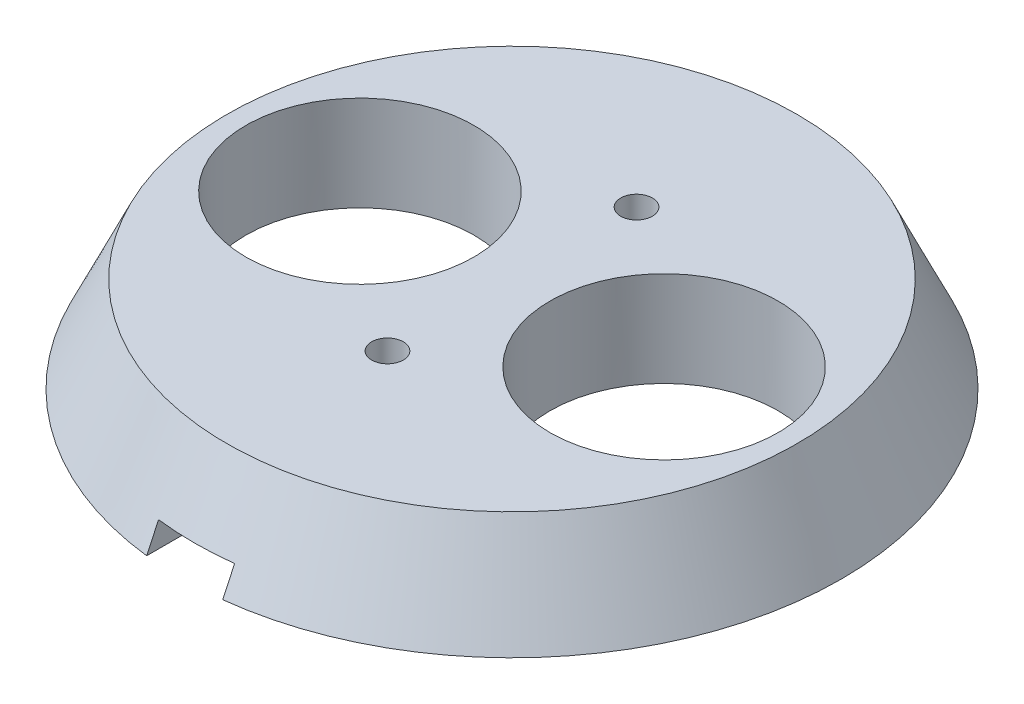
ISO-10303-21;
HEADER;
FILE_DESCRIPTION(('STEP AP214'),'2;1');
FILE_NAME('part.step','',(''),(''),'','','');
FILE_SCHEMA(('AUTOMOTIVE_DESIGN { 1 0 10303 214 1 1 1 1 }'));
ENDSEC;
DATA;
#1=APPLICATION_CONTEXT('core data for automotive mechanical design processes');
#2=APPLICATION_PROTOCOL_DEFINITION('international standard','automotive_design',2000,#1);
#3=PRODUCT_CONTEXT('',#1,'mechanical');
#4=PRODUCT('Part','Part','',(#3));
#5=PRODUCT_RELATED_PRODUCT_CATEGORY('part','',(#4));
#6=PRODUCT_DEFINITION_FORMATION('','',#4);
#7=PRODUCT_DEFINITION_CONTEXT('part definition',#1,'design');
#8=PRODUCT_DEFINITION('design','',#6,#7);
#9=PRODUCT_DEFINITION_SHAPE('','',#8);
#10=(LENGTH_UNIT() NAMED_UNIT(*) SI_UNIT(.MILLI.,.METRE.));
#11=(NAMED_UNIT(*) PLANE_ANGLE_UNIT() SI_UNIT($,.RADIAN.));
#12=(NAMED_UNIT(*) SI_UNIT($,.STERADIAN.) SOLID_ANGLE_UNIT());
#13=UNCERTAINTY_MEASURE_WITH_UNIT(LENGTH_MEASURE(1.E-05),#10,'distance_accuracy_value','');
#14=(GEOMETRIC_REPRESENTATION_CONTEXT(3) GLOBAL_UNCERTAINTY_ASSIGNED_CONTEXT((#13)) GLOBAL_UNIT_ASSIGNED_CONTEXT((#10,
#11,#12)) REPRESENTATION_CONTEXT('',''));
#15=CARTESIAN_POINT('',(0.,0.,0.));
#16=DIRECTION('',(0.,0.,1.));
#17=DIRECTION('',(1.,0.,0.));
#18=AXIS2_PLACEMENT_3D('',#15,#16,#17);
#19=CARTESIAN_POINT('',(40.5,3.5,5.));
#20=DIRECTION('',(0.,1.,0.));
#21=DIRECTION('',(0.,0.,1.));
#22=AXIS2_PLACEMENT_3D('',#19,#20,#21);
#23=CYLINDRICAL_SURFACE('',#22,8.99999999999999);
#24=CARTESIAN_POINT('',(40.5,-7.5,5.));
#25=DIRECTION('',(0.,-1.,0.));
#26=DIRECTION('',(0.,0.,-1.));
#27=AXIS2_PLACEMENT_3D('',#24,#25,#26);
#28=CIRCLE('',#27,9.);
#29=CARTESIAN_POINT('',(40.5,-7.5,-4.00000000000001));
#30=VERTEX_POINT('',#29);
#31=EDGE_CURVE('E250',#30,#30,#28,.T.);
#32=ORIENTED_EDGE('',*,*,#31,.T.);
#33=EDGE_LOOP('',(#32));
#34=FACE_BOUND('',#33,.T.);
#35=CARTESIAN_POINT('',(40.5,0.,5.));
#36=DIRECTION('',(0.,1.,0.));
#37=DIRECTION('',(0.,0.,1.));
#38=AXIS2_PLACEMENT_3D('',#35,#36,#37);
#39=CIRCLE('',#38,8.99999999999999);
#40=CARTESIAN_POINT('',(40.5,0.,14.));
#41=VERTEX_POINT('',#40);
#42=EDGE_CURVE('E223',#41,#41,#39,.F.);
#43=ORIENTED_EDGE('',*,*,#42,.F.);
#44=EDGE_LOOP('',(#43));
#45=FACE_BOUND('',#44,.T.);
#46=ADVANCED_FACE('F36',(#34,#45),#23,.F.);
#47=CARTESIAN_POINT('',(64.5,3.5,5.));
#48=DIRECTION('',(0.,1.,0.));
#49=DIRECTION('',(0.,0.,1.));
#50=AXIS2_PLACEMENT_3D('',#47,#48,#49);
#51=CYLINDRICAL_SURFACE('',#50,8.99999999999999);
#52=CARTESIAN_POINT('',(64.5,-7.5,5.));
#53=DIRECTION('',(0.,-1.,0.));
#54=DIRECTION('',(0.,0.,-1.));
#55=AXIS2_PLACEMENT_3D('',#52,#53,#54);
#56=CIRCLE('',#55,9.);
#57=CARTESIAN_POINT('',(64.5,-7.5,-4.));
#58=VERTEX_POINT('',#57);
#59=EDGE_CURVE('E247',#58,#58,#56,.T.);
#60=ORIENTED_EDGE('',*,*,#59,.T.);
#61=EDGE_LOOP('',(#60));
#62=FACE_BOUND('',#61,.T.);
#63=CARTESIAN_POINT('',(64.5,0.,5.));
#64=DIRECTION('',(0.,1.,0.));
#65=DIRECTION('',(0.,0.,1.));
#66=AXIS2_PLACEMENT_3D('',#63,#64,#65);
#67=CIRCLE('',#66,8.99999999999999);
#68=CARTESIAN_POINT('',(64.5,0.,14.));
#69=VERTEX_POINT('',#68);
#70=EDGE_CURVE('E327',#69,#69,#67,.F.);
#71=ORIENTED_EDGE('',*,*,#70,.F.);
#72=EDGE_LOOP('',(#71));
#73=FACE_BOUND('',#72,.T.);
#74=ADVANCED_FACE('F192',(#62,#73),#51,.F.);
#75=CARTESIAN_POINT('',(52.5,-7.5,5.));
#76=DIRECTION('',(0.,1.,0.));
#77=DIRECTION('',(0.,0.,1.));
#78=AXIS2_PLACEMENT_3D('',#75,#76,#77);
#79=PLANE('',#78);
#80=CARTESIAN_POINT('',(52.5,-7.5,14.8263431402899));
#81=DIRECTION('',(0.,-1.,0.));
#82=DIRECTION('',(0.,0.,-1.));
#83=AXIS2_PLACEMENT_3D('',#80,#81,#82);
#84=CIRCLE('',#83,1.24999999999999);
#85=CARTESIAN_POINT('',(52.5,-7.5,13.5763431402899));
#86=VERTEX_POINT('',#85);
#87=EDGE_CURVE('E315',#86,#86,#84,.T.);
#88=ORIENTED_EDGE('',*,*,#87,.F.);
#89=EDGE_LOOP('',(#88));
#90=FACE_BOUND('',#89,.T.);
#91=CARTESIAN_POINT('',(52.5,-7.5,-4.82634314028992));
#92=DIRECTION('',(0.,-1.,0.));
#93=DIRECTION('',(0.,0.,-1.));
#94=AXIS2_PLACEMENT_3D('',#91,#92,#93);
#95=CIRCLE('',#94,1.24999999999999);
#96=CARTESIAN_POINT('',(52.5,-7.5,-6.07634314028991));
#97=VERTEX_POINT('',#96);
#98=EDGE_CURVE('E319',#97,#97,#95,.T.);
#99=ORIENTED_EDGE('',*,*,#98,.F.);
#100=EDGE_LOOP('',(#99));
#101=FACE_BOUND('',#100,.T.);
#102=ORIENTED_EDGE('',*,*,#59,.F.);
#103=EDGE_LOOP('',(#102));
#104=FACE_BOUND('',#103,.T.);
#105=ORIENTED_EDGE('',*,*,#31,.F.);
#106=EDGE_LOOP('',(#105));
#107=FACE_BOUND('',#106,.T.);
#108=DIRECTION('',(-1.,0.,0.));
#109=VECTOR('',#108,1.);
#110=CARTESIAN_POINT('',(49.5,-7.5,-9.82634314028992));
#111=LINE('',#110,#109);
#112=CARTESIAN_POINT('',(55.5,-7.5,-9.82634314028992));
#113=VERTEX_POINT('',#112);
#114=CARTESIAN_POINT('',(49.5,-7.5,-9.82634314028992));
#115=VERTEX_POINT('',#114);
#116=EDGE_CURVE('E47',#113,#115,#111,.T.);
#117=ORIENTED_EDGE('',*,*,#116,.F.);
#118=DIRECTION('',(0.,0.,1.));
#119=VECTOR('',#118,1.);
#120=CARTESIAN_POINT('',(55.5,-7.5,-9.82634314028992));
#121=LINE('',#120,#119);
#122=CARTESIAN_POINT('',(55.5000117710377,-7.5,-20.8263431675805));
#123=VERTEX_POINT('',#122);
#124=EDGE_CURVE('E114',#123,#113,#121,.T.);
#125=ORIENTED_EDGE('',*,*,#124,.F.);
#126=CARTESIAN_POINT('',(52.5,-7.5,5.));
#127=DIRECTION('',(0.,1.,0.));
#128=DIRECTION('',(0.,0.,1.));
#129=AXIS2_PLACEMENT_3D('',#126,#127,#128);
#130=CIRCLE('',#129,26.);
#131=CARTESIAN_POINT('',(55.5,-7.5,30.8263431402899));
#132=VERTEX_POINT('',#131);
#133=EDGE_CURVE('E220',#132,#123,#130,.T.);
#134=ORIENTED_EDGE('',*,*,#133,.F.);
#135=DIRECTION('',(0.,0.,1.));
#136=VECTOR('',#135,1.);
#137=CARTESIAN_POINT('',(55.5,-7.5,19.8263431402899));
#138=LINE('',#137,#136);
#139=CARTESIAN_POINT('',(55.5,-7.5,19.8263431402899));
#140=VERTEX_POINT('',#139);
#141=EDGE_CURVE('E110',#140,#132,#138,.T.);
#142=ORIENTED_EDGE('',*,*,#141,.F.);
#143=DIRECTION('',(1.,0.,0.));
#144=VECTOR('',#143,1.);
#145=CARTESIAN_POINT('',(49.5,-7.5,19.8263431402899));
#146=LINE('',#145,#144);
#147=CARTESIAN_POINT('',(49.5,-7.5,19.8263431402899));
#148=VERTEX_POINT('',#147);
#149=EDGE_CURVE('E240',#148,#140,#146,.T.);
#150=ORIENTED_EDGE('',*,*,#149,.F.);
#151=DIRECTION('',(0.,0.,-1.));
#152=VECTOR('',#151,1.);
#153=CARTESIAN_POINT('',(49.5,-7.5,19.8263431402899));
#154=LINE('',#153,#152);
#155=CARTESIAN_POINT('',(49.4999881542383,-7.5,30.8263431589));
#156=VERTEX_POINT('',#155);
#157=EDGE_CURVE('E181',#156,#148,#154,.T.);
#158=ORIENTED_EDGE('',*,*,#157,.F.);
#159=CARTESIAN_POINT('',(49.5,-7.5,-20.8263431402899));
#160=VERTEX_POINT('',#159);
#161=EDGE_CURVE('E217',#160,#156,#130,.T.);
#162=ORIENTED_EDGE('',*,*,#161,.F.);
#163=DIRECTION('',(0.,0.,-1.));
#164=VECTOR('',#163,1.);
#165=CARTESIAN_POINT('',(49.5,-7.5,-9.82634314028992));
#166=LINE('',#165,#164);
#167=EDGE_CURVE('E212',#115,#160,#166,.T.);
#168=ORIENTED_EDGE('',*,*,#167,.F.);
#169=EDGE_LOOP('',(#117,#125,#134,#142,#150,#158,#162,#168));
#170=FACE_BOUND('',#169,.T.);
#171=ADVANCED_FACE('F38',(#90,#101,#104,#107,#170),#79,.F.);
#172=CARTESIAN_POINT('',(52.5,0.,5.));
#173=DIRECTION('',(0.,-1.,0.));
#174=DIRECTION('',(0.,0.,-1.));
#175=AXIS2_PLACEMENT_3D('',#172,#173,#174);
#176=CONICAL_SURFACE('',#175,22.5,0.436627159813542);
#177=CARTESIAN_POINT('',(55.5,12.5602768294078,-11.3658464327506));
#178=CARTESIAN_POINT('',(55.5,11.7814361719645,-11.7353564698702));
#179=CARTESIAN_POINT('',(55.5,11.0024421127457,-12.1045429455506));
#180=CARTESIAN_POINT('',(55.5,9.44419429337647,-12.8423671412298));
#181=CARTESIAN_POINT('',(55.5,8.66494053326612,-13.2110048613132));
#182=CARTESIAN_POINT('',(55.5,6.32686082731465,-14.3162422162979));
#183=CARTESIAN_POINT('',(55.5,4.76771562459884,-15.0521664400531));
#184=CARTESIAN_POINT('',(55.5,1.64882071409109,-16.5227275113106));
#185=CARTESIAN_POINT('',(55.5,0.0890710070281218,-17.2573643603595));
#186=CARTESIAN_POINT('',(55.5,-3.03087832700619,-18.7256825861429));
#187=CARTESIAN_POINT('',(55.5,-4.59107795404876,-19.459363962726));
#188=CARTESIAN_POINT('',(55.5,-7.71181727272587,-20.9259981183879));
#189=CARTESIAN_POINT('',(55.5,-9.27235696394594,-21.6589508983487));
#190=CARTESIAN_POINT('',(55.5,-12.3937028695853,-23.1242888222354));
#191=CARTESIAN_POINT('',(55.5,-13.954509084013,-23.8566739661434));
#192=CARTESIAN_POINT('',(55.5,-17.076334364193,-25.3209952321239));
#193=CARTESIAN_POINT('',(55.5,-18.6373534301945,-26.0529313536654));
#194=CARTESIAN_POINT('',(55.5,-21.7595637611938,-27.5164359187512));
#195=CARTESIAN_POINT('',(55.5,-23.320755026178,-28.2480043623246));
#196=CARTESIAN_POINT('',(55.5,-24.8820131088047,-28.9794301292932));
#197=B_SPLINE_CURVE_WITH_KNOTS('',3,(#177,#178,#179,#180,#181,#182,#183,#184,#185,#186,#187,
#188,#189,#190,#191,#192,#193,#194,#195,#196),.UNSPECIFIED.,.F.,.F.,(4,2,2,2,2,2,2,2,2,4),(0.,
2.58615018878239,5.17229997930514,10.3445968004934,15.5168874035556,20.6891788258247,
25.8614639789069,31.0337492960015,36.2060407191065,41.3783317339585),.UNSPECIFIED.);
#198=CARTESIAN_POINT('',(55.5,-5.5,-19.8864979010261));
#199=VERTEX_POINT('',#198);
#200=EDGE_CURVE('E216',#199,#123,#197,.T.);
#201=ORIENTED_EDGE('',*,*,#200,.F.);
#202=CARTESIAN_POINT('',(52.5,-5.5,5.));
#203=DIRECTION('',(0.,-1.,0.));
#204=DIRECTION('',(0.,0.,-1.));
#205=AXIS2_PLACEMENT_3D('',#202,#203,#204);
#206=CIRCLE('',#205,25.0666666666667);
#207=CARTESIAN_POINT('',(49.5,-5.5,-19.8864979010261));
#208=VERTEX_POINT('',#207);
#209=EDGE_CURVE('E107',#199,#208,#206,.F.);
#210=ORIENTED_EDGE('',*,*,#209,.T.);
#211=CARTESIAN_POINT('',(49.5,-24.8820131088047,-28.9794301292932));
#212=CARTESIAN_POINT('',(49.5,-23.320755026178,-28.2480043623246));
#213=CARTESIAN_POINT('',(49.5,-21.7595637611938,-27.5164359187512));
#214=CARTESIAN_POINT('',(49.5,-18.6373534301945,-26.0529313536654));
#215=CARTESIAN_POINT('',(49.5,-17.076334364193,-25.3209952321239));
#216=CARTESIAN_POINT('',(49.5,-13.954509084013,-23.8566739661434));
#217=CARTESIAN_POINT('',(49.5,-12.3937028695853,-23.1242888222354));
#218=CARTESIAN_POINT('',(49.5,-9.27235696394594,-21.6589508983487));
#219=CARTESIAN_POINT('',(49.5,-7.71181727272587,-20.9259981183879));
#220=CARTESIAN_POINT('',(49.5,-4.59107795404876,-19.459363962726));
#221=CARTESIAN_POINT('',(49.5,-3.03087832700619,-18.7256825861429));
#222=CARTESIAN_POINT('',(49.5,0.0890710070281212,-17.2573643603595));
#223=CARTESIAN_POINT('',(49.5,1.64882071409109,-16.5227275113106));
#224=CARTESIAN_POINT('',(49.5,4.76771562459884,-15.0521664400531));
#225=CARTESIAN_POINT('',(49.5,6.32686082731465,-14.3162422162979));
#226=CARTESIAN_POINT('',(49.5,8.66494053326612,-13.2110048613132));
#227=CARTESIAN_POINT('',(49.5,9.44419429337647,-12.8423671412298));
#228=CARTESIAN_POINT('',(49.5,11.0024421127457,-12.1045429455506));
#229=CARTESIAN_POINT('',(49.5,11.7814361719645,-11.7353564698702));
#230=CARTESIAN_POINT('',(49.5,12.5602768294078,-11.3658464327506));
#231=B_SPLINE_CURVE_WITH_KNOTS('',3,(#211,#212,#213,#214,#215,#216,#217,#218,#219,#220,#221,
#222,#223,#224,#225,#226,#227,#228,#229,#230),.UNSPECIFIED.,.F.,.F.,(4,2,2,2,2,2,2,2,2,4),(0.,
5.17229101485203,10.344582437957,15.5168677550516,20.6891529081338,25.8614443304029,
31.0337349334651,36.2060317546534,38.7921815451761,41.3783317339585),.UNSPECIFIED.);
#232=EDGE_CURVE('E119',#160,#208,#231,.T.);
#233=ORIENTED_EDGE('',*,*,#232,.F.);
#234=ORIENTED_EDGE('',*,*,#161,.T.);
#235=CARTESIAN_POINT('',(49.5,12.5602768294078,21.3658464327506));
#236=CARTESIAN_POINT('',(49.5,11.7814361719645,21.7353564698702));
#237=CARTESIAN_POINT('',(49.5,11.0024421127457,22.1045429455506));
#238=CARTESIAN_POINT('',(49.5,9.44419429337647,22.8423671412298));
#239=CARTESIAN_POINT('',(49.5,8.66494053326612,23.2110048613132));
#240=CARTESIAN_POINT('',(49.5,6.32686082731464,24.3162422162979));
#241=CARTESIAN_POINT('',(49.5,4.76771562459884,25.0521664400531));
#242=CARTESIAN_POINT('',(49.5,1.64882071409109,26.5227275113106));
#243=CARTESIAN_POINT('',(49.5,0.0890710070281259,27.2573643603595));
#244=CARTESIAN_POINT('',(49.5,-3.03087832700619,28.7256825861429));
#245=CARTESIAN_POINT('',(49.5,-4.59107795404876,29.459363962726));
#246=CARTESIAN_POINT('',(49.5,-7.71181727272587,30.9259981183879));
#247=CARTESIAN_POINT('',(49.5,-9.27235696394593,31.6589508983487));
#248=CARTESIAN_POINT('',(49.5,-12.3937028695853,33.1242888222354));
#249=CARTESIAN_POINT('',(49.5,-13.954509084013,33.8566739661434));
#250=CARTESIAN_POINT('',(49.5,-17.076334364193,35.3209952321239));
#251=CARTESIAN_POINT('',(49.5,-18.6373534301945,36.0529313536654));
#252=CARTESIAN_POINT('',(49.5,-21.7595637611937,37.5164359187512));
#253=CARTESIAN_POINT('',(49.5,-23.3207550261779,38.2480043623246));
#254=CARTESIAN_POINT('',(49.5,-24.8820131088047,38.9794301292932));
#255=B_SPLINE_CURVE_WITH_KNOTS('',3,(#235,#236,#237,#238,#239,#240,#241,#242,#243,#244,#245,
#246,#247,#248,#249,#250,#251,#252,#253,#254),.UNSPECIFIED.,.F.,.F.,(4,2,2,2,2,2,2,2,2,4),(0.,
2.58615018878239,5.17229997930514,10.3445968004934,15.5168874035556,20.6891788258247,
25.8614639789069,31.0337492960015,36.2060407191065,41.3783317339585),.UNSPECIFIED.);
#256=CARTESIAN_POINT('',(49.5,-5.5,29.8864979010261));
#257=VERTEX_POINT('',#256);
#258=EDGE_CURVE('E233',#257,#156,#255,.T.);
#259=ORIENTED_EDGE('',*,*,#258,.F.);
#260=CARTESIAN_POINT('',(52.5,-5.5,5.));
#261=DIRECTION('',(0.,1.,0.));
#262=DIRECTION('',(0.,0.,1.));
#263=AXIS2_PLACEMENT_3D('',#260,#261,#262);
#264=CIRCLE('',#263,25.0666666666667);
#265=CARTESIAN_POINT('',(55.5,-5.5,29.8864979010261));
#266=VERTEX_POINT('',#265);
#267=EDGE_CURVE('E237',#266,#257,#264,.F.);
#268=ORIENTED_EDGE('',*,*,#267,.F.);
#269=CARTESIAN_POINT('',(55.5,-24.8820131088047,38.9794301292932));
#270=CARTESIAN_POINT('',(55.5,-23.320755026178,38.2480043623246));
#271=CARTESIAN_POINT('',(55.5,-21.7595637611937,37.5164359187512));
#272=CARTESIAN_POINT('',(55.5,-18.6373534301945,36.0529313536654));
#273=CARTESIAN_POINT('',(55.5,-17.076334364193,35.3209952321239));
#274=CARTESIAN_POINT('',(55.5,-13.954509084013,33.8566739661434));
#275=CARTESIAN_POINT('',(55.5,-12.3937028695853,33.1242888222354));
#276=CARTESIAN_POINT('',(55.5,-9.27235696394594,31.6589508983487));
#277=CARTESIAN_POINT('',(55.5,-7.71181727272587,30.9259981183879));
#278=CARTESIAN_POINT('',(55.5,-4.59107795404876,29.459363962726));
#279=CARTESIAN_POINT('',(55.5,-3.03087832700619,28.7256825861429));
#280=CARTESIAN_POINT('',(55.5,0.0890710070281251,27.2573643603595));
#281=CARTESIAN_POINT('',(55.5,1.64882071409109,26.5227275113106));
#282=CARTESIAN_POINT('',(55.5,4.76771562459884,25.0521664400531));
#283=CARTESIAN_POINT('',(55.5,6.32686082731465,24.3162422162979));
#284=CARTESIAN_POINT('',(55.5,8.66494053326612,23.2110048613132));
#285=CARTESIAN_POINT('',(55.5,9.44419429337647,22.8423671412298));
#286=CARTESIAN_POINT('',(55.5,11.0024421127457,22.1045429455506));
#287=CARTESIAN_POINT('',(55.5,11.7814361719645,21.7353564698702));
#288=CARTESIAN_POINT('',(55.5,12.5602768294078,21.3658464327506));
#289=B_SPLINE_CURVE_WITH_KNOTS('',3,(#269,#270,#271,#272,#273,#274,#275,#276,#277,#278,#279,
#280,#281,#282,#283,#284,#285,#286,#287,#288),.UNSPECIFIED.,.F.,.F.,(4,2,2,2,2,2,2,2,2,4),(0.,
5.17229101485204,10.344582437957,15.5168677550516,20.6891529081338,25.8614443304029,
31.0337349334651,36.2060317546534,38.7921815451761,41.3783317339585),.UNSPECIFIED.);
#290=EDGE_CURVE('E180',#132,#266,#289,.T.);
#291=ORIENTED_EDGE('',*,*,#290,.F.);
#292=ORIENTED_EDGE('',*,*,#133,.T.);
#293=EDGE_LOOP('',(#201,#210,#233,#234,#259,#268,#291,#292));
#294=FACE_BOUND('',#293,.T.);
#295=CARTESIAN_POINT('',(52.5,0.,5.));
#296=DIRECTION('',(0.,-1.,0.));
#297=DIRECTION('',(0.,0.,-1.));
#298=AXIS2_PLACEMENT_3D('',#295,#296,#297);
#299=CIRCLE('',#298,22.5);
#300=CARTESIAN_POINT('',(52.5,0.,-17.5));
#301=VERTEX_POINT('',#300);
#302=EDGE_CURVE('E218',#301,#301,#299,.T.);
#303=ORIENTED_EDGE('',*,*,#302,.T.);
#304=EDGE_LOOP('',(#303));
#305=FACE_BOUND('',#304,.T.);
#306=ADVANCED_FACE('F130',(#294,#305),#176,.T.);
#307=CARTESIAN_POINT('',(0.,-5.5,0.));
#308=DIRECTION('',(0.,1.,0.));
#309=DIRECTION('',(0.,0.,1.));
#310=AXIS2_PLACEMENT_3D('',#307,#308,#309);
#311=PLANE('',#310);
#312=ORIENTED_EDGE('',*,*,#267,.T.);
#313=DIRECTION('',(0.,0.,-1.));
#314=VECTOR('',#313,1.);
#315=CARTESIAN_POINT('',(49.5,-5.5,19.8263431402899));
#316=LINE('',#315,#314);
#317=CARTESIAN_POINT('',(49.5,-5.5,19.8263431402899));
#318=VERTEX_POINT('',#317);
#319=EDGE_CURVE('E235',#257,#318,#316,.T.);
#320=ORIENTED_EDGE('',*,*,#319,.T.);
#321=DIRECTION('',(1.,0.,0.));
#322=VECTOR('',#321,1.);
#323=CARTESIAN_POINT('',(49.5,-5.5,19.8263431402899));
#324=LINE('',#323,#322);
#325=CARTESIAN_POINT('',(55.5,-5.5,19.8263431402899));
#326=VERTEX_POINT('',#325);
#327=EDGE_CURVE('E234',#318,#326,#324,.T.);
#328=ORIENTED_EDGE('',*,*,#327,.T.);
#329=DIRECTION('',(0.,0.,1.));
#330=VECTOR('',#329,1.);
#331=CARTESIAN_POINT('',(55.5,-5.5,19.8263431402899));
#332=LINE('',#331,#330);
#333=EDGE_CURVE('E231',#326,#266,#332,.T.);
#334=ORIENTED_EDGE('',*,*,#333,.T.);
#335=EDGE_LOOP('',(#312,#320,#328,#334));
#336=FACE_BOUND('',#335,.T.);
#337=ADVANCED_FACE('F139',(#336),#311,.F.);
#338=CARTESIAN_POINT('',(49.5,-5.5,19.8263431402899));
#339=DIRECTION('',(-1.,0.,0.));
#340=DIRECTION('',(0.,0.,1.));
#341=AXIS2_PLACEMENT_3D('',#338,#339,#340);
#342=PLANE('',#341);
#343=ORIENTED_EDGE('',*,*,#258,.T.);
#344=ORIENTED_EDGE('',*,*,#157,.T.);
#345=DIRECTION('',(0.,-1.,0.));
#346=VECTOR('',#345,1.);
#347=CARTESIAN_POINT('',(49.5,-5.5,19.8263431402899));
#348=LINE('',#347,#346);
#349=EDGE_CURVE('E243',#318,#148,#348,.T.);
#350=ORIENTED_EDGE('',*,*,#349,.F.);
#351=ORIENTED_EDGE('',*,*,#319,.F.);
#352=EDGE_LOOP('',(#343,#344,#350,#351));
#353=FACE_BOUND('',#352,.T.);
#354=ADVANCED_FACE('F189',(#353),#342,.F.);
#355=CARTESIAN_POINT('',(49.5,-5.5,19.8263431402899));
#356=DIRECTION('',(0.,0.,-1.));
#357=DIRECTION('',(-1.,0.,0.));
#358=AXIS2_PLACEMENT_3D('',#355,#356,#357);
#359=PLANE('',#358);
#360=ORIENTED_EDGE('',*,*,#149,.T.);
#361=DIRECTION('',(0.,-1.,0.));
#362=VECTOR('',#361,1.);
#363=CARTESIAN_POINT('',(55.5,-5.5,19.8263431402899));
#364=LINE('',#363,#362);
#365=EDGE_CURVE('E244',#326,#140,#364,.T.);
#366=ORIENTED_EDGE('',*,*,#365,.F.);
#367=ORIENTED_EDGE('',*,*,#327,.F.);
#368=ORIENTED_EDGE('',*,*,#349,.T.);
#369=EDGE_LOOP('',(#360,#366,#367,#368));
#370=FACE_BOUND('',#369,.T.);
#371=ADVANCED_FACE('F187',(#370),#359,.F.);
#372=CARTESIAN_POINT('',(55.5,-5.5,19.8263431402899));
#373=DIRECTION('',(1.,0.,0.));
#374=DIRECTION('',(0.,0.,-1.));
#375=AXIS2_PLACEMENT_3D('',#372,#373,#374);
#376=PLANE('',#375);
#377=ORIENTED_EDGE('',*,*,#290,.T.);
#378=ORIENTED_EDGE('',*,*,#333,.F.);
#379=ORIENTED_EDGE('',*,*,#365,.T.);
#380=ORIENTED_EDGE('',*,*,#141,.T.);
#381=EDGE_LOOP('',(#377,#378,#379,#380));
#382=FACE_BOUND('',#381,.T.);
#383=ADVANCED_FACE('F183',(#382),#376,.F.);
#384=CARTESIAN_POINT('',(0.,-5.5,0.));
#385=DIRECTION('',(0.,-1.,0.));
#386=DIRECTION('',(0.,0.,-1.));
#387=AXIS2_PLACEMENT_3D('',#384,#385,#386);
#388=PLANE('',#387);
#389=DIRECTION('',(0.,0.,1.));
#390=VECTOR('',#389,1.);
#391=CARTESIAN_POINT('',(55.5,-5.5,-9.82634314028992));
#392=LINE('',#391,#390);
#393=CARTESIAN_POINT('',(55.5,-5.5,-9.82634314028992));
#394=VERTEX_POINT('',#393);
#395=EDGE_CURVE('E103',#199,#394,#392,.T.);
#396=ORIENTED_EDGE('',*,*,#395,.T.);
#397=DIRECTION('',(-1.,0.,0.));
#398=VECTOR('',#397,1.);
#399=CARTESIAN_POINT('',(49.5,-5.5,-9.82634314028992));
#400=LINE('',#399,#398);
#401=CARTESIAN_POINT('',(49.5,-5.5,-9.82634314028992));
#402=VERTEX_POINT('',#401);
#403=EDGE_CURVE('E105',#394,#402,#400,.T.);
#404=ORIENTED_EDGE('',*,*,#403,.T.);
#405=DIRECTION('',(0.,0.,-1.));
#406=VECTOR('',#405,1.);
#407=CARTESIAN_POINT('',(49.5,-5.5,-9.82634314028992));
#408=LINE('',#407,#406);
#409=EDGE_CURVE('E99',#402,#208,#408,.T.);
#410=ORIENTED_EDGE('',*,*,#409,.T.);
#411=ORIENTED_EDGE('',*,*,#209,.F.);
#412=EDGE_LOOP('',(#396,#404,#410,#411));
#413=FACE_BOUND('',#412,.T.);
#414=ADVANCED_FACE('F104',(#413),#388,.T.);
#415=CARTESIAN_POINT('',(49.5,-5.5,-9.82634314028992));
#416=DIRECTION('',(-1.,0.,0.));
#417=DIRECTION('',(0.,0.,1.));
#418=AXIS2_PLACEMENT_3D('',#415,#416,#417);
#419=PLANE('',#418);
#420=ORIENTED_EDGE('',*,*,#232,.T.);
#421=ORIENTED_EDGE('',*,*,#409,.F.);
#422=DIRECTION('',(0.,-1.,0.));
#423=VECTOR('',#422,1.);
#424=CARTESIAN_POINT('',(49.5,-5.5,-9.82634314028992));
#425=LINE('',#424,#423);
#426=EDGE_CURVE('E117',#402,#115,#425,.T.);
#427=ORIENTED_EDGE('',*,*,#426,.T.);
#428=ORIENTED_EDGE('',*,*,#167,.T.);
#429=EDGE_LOOP('',(#420,#421,#427,#428));
#430=FACE_BOUND('',#429,.T.);
#431=ADVANCED_FACE('F201',(#430),#419,.F.);
#432=CARTESIAN_POINT('',(55.5,-5.5,-9.82634314028992));
#433=DIRECTION('',(1.,0.,0.));
#434=DIRECTION('',(0.,0.,-1.));
#435=AXIS2_PLACEMENT_3D('',#432,#433,#434);
#436=PLANE('',#435);
#437=ORIENTED_EDGE('',*,*,#200,.T.);
#438=ORIENTED_EDGE('',*,*,#124,.T.);
#439=DIRECTION('',(0.,-1.,0.));
#440=VECTOR('',#439,1.);
#441=CARTESIAN_POINT('',(55.5,-5.5,-9.82634314028992));
#442=LINE('',#441,#440);
#443=EDGE_CURVE('E12',#394,#113,#442,.T.);
#444=ORIENTED_EDGE('',*,*,#443,.F.);
#445=ORIENTED_EDGE('',*,*,#395,.F.);
#446=EDGE_LOOP('',(#437,#438,#444,#445));
#447=FACE_BOUND('',#446,.T.);
#448=ADVANCED_FACE('F112',(#447),#436,.F.);
#449=CARTESIAN_POINT('',(49.5,-5.5,-9.82634314028992));
#450=DIRECTION('',(0.,0.,1.));
#451=DIRECTION('',(1.,0.,0.));
#452=AXIS2_PLACEMENT_3D('',#449,#450,#451);
#453=PLANE('',#452);
#454=ORIENTED_EDGE('',*,*,#116,.T.);
#455=ORIENTED_EDGE('',*,*,#426,.F.);
#456=ORIENTED_EDGE('',*,*,#403,.F.);
#457=ORIENTED_EDGE('',*,*,#443,.T.);
#458=EDGE_LOOP('',(#454,#455,#456,#457));
#459=FACE_BOUND('',#458,.T.);
#460=ADVANCED_FACE('F116',(#459),#453,.F.);
#461=CARTESIAN_POINT('',(52.5,0.,5.));
#462=DIRECTION('',(0.,1.,0.));
#463=DIRECTION('',(0.,0.,1.));
#464=AXIS2_PLACEMENT_3D('',#461,#462,#463);
#465=PLANE('',#464);
#466=CARTESIAN_POINT('',(52.5,0.,14.8263431402899));
#467=DIRECTION('',(0.,1.,0.));
#468=DIRECTION('',(0.,0.,1.));
#469=AXIS2_PLACEMENT_3D('',#466,#467,#468);
#470=CIRCLE('',#469,1.24999999999999);
#471=CARTESIAN_POINT('',(52.5,0.,16.0763431402899));
#472=VERTEX_POINT('',#471);
#473=EDGE_CURVE('E333',#472,#472,#470,.T.);
#474=ORIENTED_EDGE('',*,*,#473,.F.);
#475=EDGE_LOOP('',(#474));
#476=FACE_BOUND('',#475,.T.);
#477=CARTESIAN_POINT('',(52.5,0.,-4.82634314028992));
#478=DIRECTION('',(0.,1.,0.));
#479=DIRECTION('',(0.,0.,1.));
#480=AXIS2_PLACEMENT_3D('',#477,#478,#479);
#481=CIRCLE('',#480,1.24999999999999);
#482=CARTESIAN_POINT('',(52.5,0.,-3.57634314028993));
#483=VERTEX_POINT('',#482);
#484=EDGE_CURVE('E41',#483,#483,#481,.T.);
#485=ORIENTED_EDGE('',*,*,#484,.F.);
#486=EDGE_LOOP('',(#485));
#487=FACE_BOUND('',#486,.T.);
#488=ORIENTED_EDGE('',*,*,#302,.F.);
#489=EDGE_LOOP('',(#488));
#490=FACE_BOUND('',#489,.T.);
#491=ORIENTED_EDGE('',*,*,#70,.T.);
#492=EDGE_LOOP('',(#491));
#493=FACE_BOUND('',#492,.T.);
#494=ORIENTED_EDGE('',*,*,#42,.T.);
#495=EDGE_LOOP('',(#494));
#496=FACE_BOUND('',#495,.T.);
#497=ADVANCED_FACE('F203',(#476,#487,#490,#493,#496),#465,.T.);
#498=CARTESIAN_POINT('',(52.5,-7.5,-4.82634314028992));
#499=DIRECTION('',(0.,-1.,0.));
#500=DIRECTION('',(0.,0.,-1.));
#501=AXIS2_PLACEMENT_3D('',#498,#499,#500);
#502=CYLINDRICAL_SURFACE('',#501,1.24999999999999);
#503=ORIENTED_EDGE('',*,*,#484,.T.);
#504=EDGE_LOOP('',(#503));
#505=FACE_BOUND('',#504,.T.);
#506=ORIENTED_EDGE('',*,*,#98,.T.);
#507=EDGE_LOOP('',(#506));
#508=FACE_BOUND('',#507,.T.);
#509=ADVANCED_FACE('F272',(#505,#508),#502,.F.);
#510=CARTESIAN_POINT('',(52.5,-7.5,14.8263431402899));
#511=DIRECTION('',(0.,-1.,0.));
#512=DIRECTION('',(0.,0.,-1.));
#513=AXIS2_PLACEMENT_3D('',#510,#511,#512);
#514=CYLINDRICAL_SURFACE('',#513,1.24999999999999);
#515=ORIENTED_EDGE('',*,*,#473,.T.);
#516=EDGE_LOOP('',(#515));
#517=FACE_BOUND('',#516,.T.);
#518=ORIENTED_EDGE('',*,*,#87,.T.);
#519=EDGE_LOOP('',(#518));
#520=FACE_BOUND('',#519,.T.);
#521=ADVANCED_FACE('F337',(#517,#520),#514,.F.);
#522=CLOSED_SHELL('',(#46,#74,#171,#306,#337,#354,#371,#383,#414,#431,#448,#460,#497,#509,#521));
#523=MANIFOLD_SOLID_BREP('B2',#522);
#524=ADVANCED_BREP_SHAPE_REPRESENTATION('',(#18,#523),#14);
#525=SHAPE_DEFINITION_REPRESENTATION(#9,#524);
ENDSEC;
END-ISO-10303-21;
